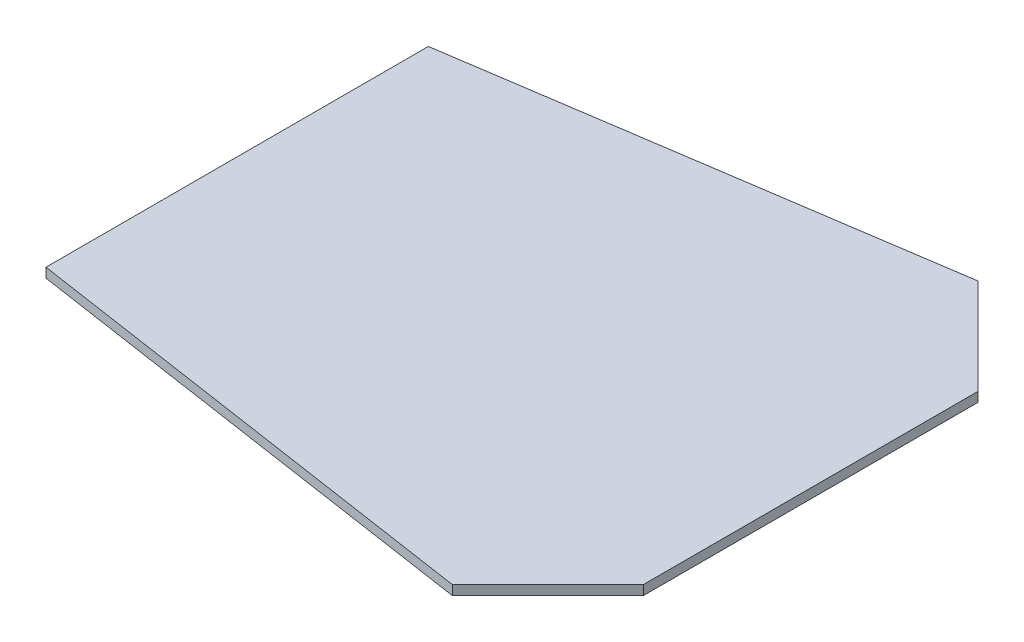
ISO-10303-21;
HEADER;
FILE_DESCRIPTION(('STEP AP214'),'2;1');
FILE_NAME('part.step','',(''),(''),'','','');
FILE_SCHEMA(('AUTOMOTIVE_DESIGN { 1 0 10303 214 1 1 1 1 }'));
ENDSEC;
DATA;
#1=APPLICATION_CONTEXT('core data for automotive mechanical design processes');
#2=APPLICATION_PROTOCOL_DEFINITION('international standard','automotive_design',2000,#1);
#3=PRODUCT_CONTEXT('',#1,'mechanical');
#4=PRODUCT('Part','Part','',(#3));
#5=PRODUCT_RELATED_PRODUCT_CATEGORY('part','',(#4));
#6=PRODUCT_DEFINITION_FORMATION('','',#4);
#7=PRODUCT_DEFINITION_CONTEXT('part definition',#1,'design');
#8=PRODUCT_DEFINITION('design','',#6,#7);
#9=PRODUCT_DEFINITION_SHAPE('','',#8);
#10=(LENGTH_UNIT() NAMED_UNIT(*) SI_UNIT(.MILLI.,.METRE.));
#11=(NAMED_UNIT(*) PLANE_ANGLE_UNIT() SI_UNIT($,.RADIAN.));
#12=(NAMED_UNIT(*) SI_UNIT($,.STERADIAN.) SOLID_ANGLE_UNIT());
#13=UNCERTAINTY_MEASURE_WITH_UNIT(LENGTH_MEASURE(1.E-05),#10,'distance_accuracy_value','');
#14=(GEOMETRIC_REPRESENTATION_CONTEXT(3) GLOBAL_UNCERTAINTY_ASSIGNED_CONTEXT((#13)) GLOBAL_UNIT_ASSIGNED_CONTEXT((#10,
#11,#12)) REPRESENTATION_CONTEXT('',''));
#15=CARTESIAN_POINT('',(0.,0.,0.));
#16=DIRECTION('',(0.,0.,1.));
#17=DIRECTION('',(1.,0.,0.));
#18=AXIS2_PLACEMENT_3D('',#15,#16,#17);
#19=CARTESIAN_POINT('',(500.,5.,-275.));
#20=DIRECTION('',(0.148340452930245,0.,0.988936352868298));
#21=DIRECTION('',(0.988936352868298,0.,-0.148340452930245));
#22=AXIS2_PLACEMENT_3D('',#19,#20,#21);
#23=PLANE('',#22);
#24=DIRECTION('',(-0.988936352868298,0.,0.148340452930245));
#25=VECTOR('',#24,1.);
#26=CARTESIAN_POINT('',(500.,-5.,-275.));
#27=LINE('',#26,#25);
#28=CARTESIAN_POINT('',(500.,-5.,-275.));
#29=VERTEX_POINT('',#28);
#30=CARTESIAN_POINT('',(0.,-5.,-200.));
#31=VERTEX_POINT('',#30);
#32=EDGE_CURVE('E136',#29,#31,#27,.T.);
#33=ORIENTED_EDGE('',*,*,#32,.T.);
#34=DIRECTION('',(0.,-1.,0.));
#35=VECTOR('',#34,1.);
#36=CARTESIAN_POINT('',(0.,5.,-200.));
#37=LINE('',#36,#35);
#38=CARTESIAN_POINT('',(0.,5.,-200.));
#39=VERTEX_POINT('',#38);
#40=EDGE_CURVE('E11',#39,#31,#37,.T.);
#41=ORIENTED_EDGE('',*,*,#40,.F.);
#42=DIRECTION('',(-0.988936352868298,0.,0.148340452930245));
#43=VECTOR('',#42,1.);
#44=CARTESIAN_POINT('',(500.,5.,-275.));
#45=LINE('',#44,#43);
#46=CARTESIAN_POINT('',(500.,5.,-275.));
#47=VERTEX_POINT('',#46);
#48=EDGE_CURVE('E152',#47,#39,#45,.T.);
#49=ORIENTED_EDGE('',*,*,#48,.F.);
#50=DIRECTION('',(0.,-1.,0.));
#51=VECTOR('',#50,1.);
#52=CARTESIAN_POINT('',(500.,5.,-275.));
#53=LINE('',#52,#51);
#54=EDGE_CURVE('E132',#47,#29,#53,.T.);
#55=ORIENTED_EDGE('',*,*,#54,.T.);
#56=EDGE_LOOP('',(#33,#41,#49,#55));
#57=FACE_BOUND('',#56,.T.);
#58=ADVANCED_FACE('F47',(#57),#23,.F.);
#59=CARTESIAN_POINT('',(0.,5.,-200.));
#60=DIRECTION('',(1.,0.,0.));
#61=DIRECTION('',(0.,0.,-1.));
#62=AXIS2_PLACEMENT_3D('',#59,#60,#61);
#63=PLANE('',#62);
#64=DIRECTION('',(0.,0.,1.));
#65=VECTOR('',#64,1.);
#66=CARTESIAN_POINT('',(0.,-5.,-200.));
#67=LINE('',#66,#65);
#68=CARTESIAN_POINT('',(0.,-5.,200.));
#69=VERTEX_POINT('',#68);
#70=EDGE_CURVE('E140',#31,#69,#67,.T.);
#71=ORIENTED_EDGE('',*,*,#70,.T.);
#72=DIRECTION('',(0.,-1.,0.));
#73=VECTOR('',#72,1.);
#74=CARTESIAN_POINT('',(0.,5.,200.));
#75=LINE('',#74,#73);
#76=CARTESIAN_POINT('',(0.,5.,200.));
#77=VERTEX_POINT('',#76);
#78=EDGE_CURVE('E56',#77,#69,#75,.T.);
#79=ORIENTED_EDGE('',*,*,#78,.F.);
#80=DIRECTION('',(0.,0.,1.));
#81=VECTOR('',#80,1.);
#82=CARTESIAN_POINT('',(0.,5.,-200.));
#83=LINE('',#82,#81);
#84=EDGE_CURVE('E101',#39,#77,#83,.T.);
#85=ORIENTED_EDGE('',*,*,#84,.F.);
#86=ORIENTED_EDGE('',*,*,#40,.T.);
#87=EDGE_LOOP('',(#71,#79,#85,#86));
#88=FACE_BOUND('',#87,.T.);
#89=ADVANCED_FACE('F180',(#88),#63,.F.);
#90=CARTESIAN_POINT('',(500.,5.,275.));
#91=DIRECTION('',(0.148340452930245,0.,-0.988936352868298));
#92=DIRECTION('',(-0.988936352868298,0.,-0.148340452930245));
#93=AXIS2_PLACEMENT_3D('',#90,#91,#92);
#94=PLANE('',#93);
#95=DIRECTION('',(0.988936352868297,0.,0.148340452930245));
#96=VECTOR('',#95,1.);
#97=CARTESIAN_POINT('',(500.,-5.,275.));
#98=LINE('',#97,#96);
#99=CARTESIAN_POINT('',(500.,-5.,275.));
#100=VERTEX_POINT('',#99);
#101=EDGE_CURVE('E143',#69,#100,#98,.T.);
#102=ORIENTED_EDGE('',*,*,#101,.T.);
#103=DIRECTION('',(0.,-1.,0.));
#104=VECTOR('',#103,1.);
#105=CARTESIAN_POINT('',(500.,5.,275.));
#106=LINE('',#105,#104);
#107=CARTESIAN_POINT('',(500.,5.,275.));
#108=VERTEX_POINT('',#107);
#109=EDGE_CURVE('E125',#108,#100,#106,.T.);
#110=ORIENTED_EDGE('',*,*,#109,.F.);
#111=DIRECTION('',(0.988936352868297,0.,0.148340452930245));
#112=VECTOR('',#111,1.);
#113=CARTESIAN_POINT('',(500.,5.,275.));
#114=LINE('',#113,#112);
#115=EDGE_CURVE('E114',#77,#108,#114,.T.);
#116=ORIENTED_EDGE('',*,*,#115,.F.);
#117=ORIENTED_EDGE('',*,*,#78,.T.);
#118=EDGE_LOOP('',(#102,#110,#116,#117));
#119=FACE_BOUND('',#118,.T.);
#120=ADVANCED_FACE('F162',(#119),#94,.F.);
#121=CARTESIAN_POINT('',(600.,5.,175.));
#122=DIRECTION('',(-0.707106781186548,0.,-0.707106781186547));
#123=DIRECTION('',(-0.707106781186547,0.,0.707106781186548));
#124=AXIS2_PLACEMENT_3D('',#121,#122,#123);
#125=PLANE('',#124);
#126=DIRECTION('',(0.707106781186547,0.,-0.707106781186548));
#127=VECTOR('',#126,1.);
#128=CARTESIAN_POINT('',(600.,-5.,175.));
#129=LINE('',#128,#127);
#130=CARTESIAN_POINT('',(600.,-5.,175.));
#131=VERTEX_POINT('',#130);
#132=EDGE_CURVE('E123',#100,#131,#129,.T.);
#133=ORIENTED_EDGE('',*,*,#132,.T.);
#134=DIRECTION('',(0.,-1.,0.));
#135=VECTOR('',#134,1.);
#136=CARTESIAN_POINT('',(600.,5.,175.));
#137=LINE('',#136,#135);
#138=CARTESIAN_POINT('',(600.,5.,175.));
#139=VERTEX_POINT('',#138);
#140=EDGE_CURVE('E120',#139,#131,#137,.T.);
#141=ORIENTED_EDGE('',*,*,#140,.F.);
#142=DIRECTION('',(0.707106781186547,0.,-0.707106781186548));
#143=VECTOR('',#142,1.);
#144=CARTESIAN_POINT('',(600.,5.,175.));
#145=LINE('',#144,#143);
#146=EDGE_CURVE('E108',#108,#139,#145,.T.);
#147=ORIENTED_EDGE('',*,*,#146,.F.);
#148=ORIENTED_EDGE('',*,*,#109,.T.);
#149=EDGE_LOOP('',(#133,#141,#147,#148));
#150=FACE_BOUND('',#149,.T.);
#151=ADVANCED_FACE('F121',(#150),#125,.F.);
#152=CARTESIAN_POINT('',(600.,5.,-175.));
#153=DIRECTION('',(-1.,0.,0.));
#154=DIRECTION('',(0.,0.,1.));
#155=AXIS2_PLACEMENT_3D('',#152,#153,#154);
#156=PLANE('',#155);
#157=DIRECTION('',(0.,0.,-1.));
#158=VECTOR('',#157,1.);
#159=CARTESIAN_POINT('',(600.,-5.,-175.));
#160=LINE('',#159,#158);
#161=CARTESIAN_POINT('',(600.,-5.,-175.));
#162=VERTEX_POINT('',#161);
#163=EDGE_CURVE('E87',#131,#162,#160,.T.);
#164=ORIENTED_EDGE('',*,*,#163,.T.);
#165=DIRECTION('',(0.,-1.,0.));
#166=VECTOR('',#165,1.);
#167=CARTESIAN_POINT('',(600.,5.,-175.));
#168=LINE('',#167,#166);
#169=CARTESIAN_POINT('',(600.,5.,-175.));
#170=VERTEX_POINT('',#169);
#171=EDGE_CURVE('E126',#170,#162,#168,.T.);
#172=ORIENTED_EDGE('',*,*,#171,.F.);
#173=DIRECTION('',(0.,0.,-1.));
#174=VECTOR('',#173,1.);
#175=CARTESIAN_POINT('',(600.,5.,-175.));
#176=LINE('',#175,#174);
#177=EDGE_CURVE('E112',#139,#170,#176,.T.);
#178=ORIENTED_EDGE('',*,*,#177,.F.);
#179=ORIENTED_EDGE('',*,*,#140,.T.);
#180=EDGE_LOOP('',(#164,#172,#178,#179));
#181=FACE_BOUND('',#180,.T.);
#182=ADVANCED_FACE('F128',(#181),#156,.F.);
#183=CARTESIAN_POINT('',(600.,5.,-175.));
#184=DIRECTION('',(-0.707106781186548,0.,0.707106781186547));
#185=DIRECTION('',(0.707106781186547,0.,0.707106781186548));
#186=AXIS2_PLACEMENT_3D('',#183,#184,#185);
#187=PLANE('',#186);
#188=DIRECTION('',(-0.707106781186547,0.,-0.707106781186548));
#189=VECTOR('',#188,1.);
#190=CARTESIAN_POINT('',(600.,-5.,-175.));
#191=LINE('',#190,#189);
#192=EDGE_CURVE('E93',#162,#29,#191,.T.);
#193=ORIENTED_EDGE('',*,*,#192,.T.);
#194=ORIENTED_EDGE('',*,*,#54,.F.);
#195=DIRECTION('',(-0.707106781186547,0.,-0.707106781186548));
#196=VECTOR('',#195,1.);
#197=CARTESIAN_POINT('',(600.,5.,-175.));
#198=LINE('',#197,#196);
#199=EDGE_CURVE('E64',#170,#47,#198,.T.);
#200=ORIENTED_EDGE('',*,*,#199,.F.);
#201=ORIENTED_EDGE('',*,*,#171,.T.);
#202=EDGE_LOOP('',(#193,#194,#200,#201));
#203=FACE_BOUND('',#202,.T.);
#204=ADVANCED_FACE('F169',(#203),#187,.F.);
#205=CARTESIAN_POINT('',(0.,5.,0.));
#206=DIRECTION('',(0.,1.,0.));
#207=DIRECTION('',(0.,0.,1.));
#208=AXIS2_PLACEMENT_3D('',#205,#206,#207);
#209=PLANE('',#208);
#210=ORIENTED_EDGE('',*,*,#48,.T.);
#211=ORIENTED_EDGE('',*,*,#84,.T.);
#212=ORIENTED_EDGE('',*,*,#115,.T.);
#213=ORIENTED_EDGE('',*,*,#146,.T.);
#214=ORIENTED_EDGE('',*,*,#177,.T.);
#215=ORIENTED_EDGE('',*,*,#199,.T.);
#216=EDGE_LOOP('',(#210,#211,#212,#213,#214,#215));
#217=FACE_BOUND('',#216,.T.);
#218=ADVANCED_FACE('F110',(#217),#209,.T.);
#219=CARTESIAN_POINT('',(0.,-5.,0.));
#220=DIRECTION('',(0.,1.,0.));
#221=DIRECTION('',(0.,0.,1.));
#222=AXIS2_PLACEMENT_3D('',#219,#220,#221);
#223=PLANE('',#222);
#224=ORIENTED_EDGE('',*,*,#32,.F.);
#225=ORIENTED_EDGE('',*,*,#192,.F.);
#226=ORIENTED_EDGE('',*,*,#163,.F.);
#227=ORIENTED_EDGE('',*,*,#132,.F.);
#228=ORIENTED_EDGE('',*,*,#101,.F.);
#229=ORIENTED_EDGE('',*,*,#70,.F.);
#230=EDGE_LOOP('',(#224,#225,#226,#227,#228,#229));
#231=FACE_BOUND('',#230,.T.);
#232=ADVANCED_FACE('F165',(#231),#223,.F.);
#233=CLOSED_SHELL('',(#58,#89,#120,#151,#182,#204,#218,#232));
#234=MANIFOLD_SOLID_BREP('B2',#233);
#235=ADVANCED_BREP_SHAPE_REPRESENTATION('',(#18,#234),#14);
#236=SHAPE_DEFINITION_REPRESENTATION(#9,#235);
ENDSEC;
END-ISO-10303-21;
